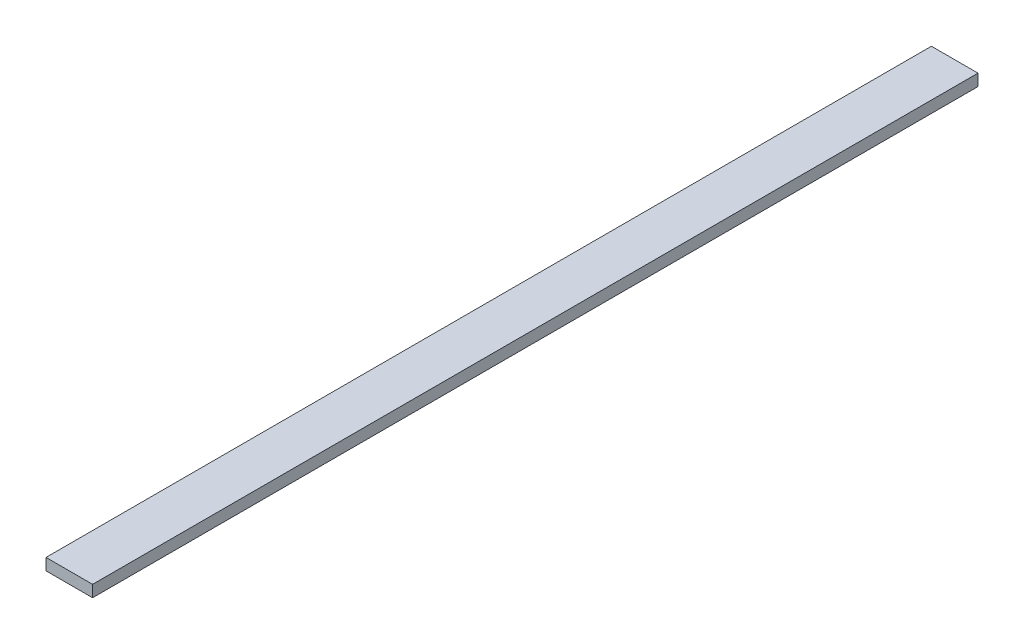
ISO-10303-21;
HEADER;
FILE_DESCRIPTION(('STEP AP214'),'2;1');
FILE_NAME('part.step','',(''),(''),'','','');
FILE_SCHEMA(('AUTOMOTIVE_DESIGN { 1 0 10303 214 1 1 1 1 }'));
ENDSEC;
DATA;
#1=APPLICATION_CONTEXT('core data for automotive mechanical design processes');
#2=APPLICATION_PROTOCOL_DEFINITION('international standard','automotive_design',2000,#1);
#3=PRODUCT_CONTEXT('',#1,'mechanical');
#4=PRODUCT('Part','Part','',(#3));
#5=PRODUCT_RELATED_PRODUCT_CATEGORY('part','',(#4));
#6=PRODUCT_DEFINITION_FORMATION('','',#4);
#7=PRODUCT_DEFINITION_CONTEXT('part definition',#1,'design');
#8=PRODUCT_DEFINITION('design','',#6,#7);
#9=PRODUCT_DEFINITION_SHAPE('','',#8);
#10=(LENGTH_UNIT() NAMED_UNIT(*) SI_UNIT(.MILLI.,.METRE.));
#11=(NAMED_UNIT(*) PLANE_ANGLE_UNIT() SI_UNIT($,.RADIAN.));
#12=(NAMED_UNIT(*) SI_UNIT($,.STERADIAN.) SOLID_ANGLE_UNIT());
#13=UNCERTAINTY_MEASURE_WITH_UNIT(LENGTH_MEASURE(1.E-05),#10,'distance_accuracy_value','');
#14=(GEOMETRIC_REPRESENTATION_CONTEXT(3) GLOBAL_UNCERTAINTY_ASSIGNED_CONTEXT((#13)) GLOBAL_UNIT_ASSIGNED_CONTEXT((#10,
#11,#12)) REPRESENTATION_CONTEXT('',''));
#15=CARTESIAN_POINT('',(0.,0.,0.));
#16=DIRECTION('',(0.,0.,1.));
#17=DIRECTION('',(1.,0.,0.));
#18=AXIS2_PLACEMENT_3D('',#15,#16,#17);
#19=CARTESIAN_POINT('',(0.,0.,241.3));
#20=DIRECTION('',(1.,0.,0.));
#21=DIRECTION('',(0.,0.,-1.));
#22=AXIS2_PLACEMENT_3D('',#19,#20,#21);
#23=PLANE('',#22);
#24=DIRECTION('',(0.,-1.,0.));
#25=VECTOR('',#24,1.);
#26=CARTESIAN_POINT('',(0.,0.,0.));
#27=LINE('',#26,#25);
#28=CARTESIAN_POINT('',(0.,3.175,0.));
#29=VERTEX_POINT('',#28);
#30=CARTESIAN_POINT('',(0.,0.,0.));
#31=VERTEX_POINT('',#30);
#32=EDGE_CURVE('E104',#29,#31,#27,.T.);
#33=ORIENTED_EDGE('',*,*,#32,.T.);
#34=DIRECTION('',(0.,0.,-1.));
#35=VECTOR('',#34,1.);
#36=CARTESIAN_POINT('',(0.,0.,241.3));
#37=LINE('',#36,#35);
#38=CARTESIAN_POINT('',(0.,0.,241.3));
#39=VERTEX_POINT('',#38);
#40=EDGE_CURVE('E11',#39,#31,#37,.T.);
#41=ORIENTED_EDGE('',*,*,#40,.F.);
#42=DIRECTION('',(0.,-1.,0.));
#43=VECTOR('',#42,1.);
#44=CARTESIAN_POINT('',(0.,0.,241.3));
#45=LINE('',#44,#43);
#46=CARTESIAN_POINT('',(0.,3.175,241.3));
#47=VERTEX_POINT('',#46);
#48=EDGE_CURVE('E92',#47,#39,#45,.T.);
#49=ORIENTED_EDGE('',*,*,#48,.F.);
#50=DIRECTION('',(0.,0.,-1.));
#51=VECTOR('',#50,1.);
#52=CARTESIAN_POINT('',(0.,3.175,241.3));
#53=LINE('',#52,#51);
#54=EDGE_CURVE('E100',#47,#29,#53,.T.);
#55=ORIENTED_EDGE('',*,*,#54,.T.);
#56=EDGE_LOOP('',(#33,#41,#49,#55));
#57=FACE_BOUND('',#56,.T.);
#58=ADVANCED_FACE('F41',(#57),#23,.F.);
#59=CARTESIAN_POINT('',(0.,0.,241.3));
#60=DIRECTION('',(0.,1.,0.));
#61=DIRECTION('',(0.,0.,1.));
#62=AXIS2_PLACEMENT_3D('',#59,#60,#61);
#63=PLANE('',#62);
#64=DIRECTION('',(1.,0.,0.));
#65=VECTOR('',#64,1.);
#66=CARTESIAN_POINT('',(0.,0.,0.));
#67=LINE('',#66,#65);
#68=CARTESIAN_POINT('',(12.7,0.,0.));
#69=VERTEX_POINT('',#68);
#70=EDGE_CURVE('E96',#31,#69,#67,.T.);
#71=ORIENTED_EDGE('',*,*,#70,.T.);
#72=DIRECTION('',(0.,0.,-1.));
#73=VECTOR('',#72,1.);
#74=CARTESIAN_POINT('',(12.7,0.,241.3));
#75=LINE('',#74,#73);
#76=CARTESIAN_POINT('',(12.7,0.,241.3));
#77=VERTEX_POINT('',#76);
#78=EDGE_CURVE('E49',#77,#69,#75,.T.);
#79=ORIENTED_EDGE('',*,*,#78,.F.);
#80=DIRECTION('',(1.,0.,0.));
#81=VECTOR('',#80,1.);
#82=CARTESIAN_POINT('',(0.,0.,241.3));
#83=LINE('',#82,#81);
#84=EDGE_CURVE('E87',#39,#77,#83,.T.);
#85=ORIENTED_EDGE('',*,*,#84,.F.);
#86=ORIENTED_EDGE('',*,*,#40,.T.);
#87=EDGE_LOOP('',(#71,#79,#85,#86));
#88=FACE_BOUND('',#87,.T.);
#89=ADVANCED_FACE('F95',(#88),#63,.F.);
#90=CARTESIAN_POINT('',(12.7,0.,241.3));
#91=DIRECTION('',(-1.,0.,0.));
#92=DIRECTION('',(0.,0.,1.));
#93=AXIS2_PLACEMENT_3D('',#90,#91,#92);
#94=PLANE('',#93);
#95=DIRECTION('',(0.,1.,0.));
#96=VECTOR('',#95,1.);
#97=CARTESIAN_POINT('',(12.7,0.,0.));
#98=LINE('',#97,#96);
#99=CARTESIAN_POINT('',(12.7,3.175,0.));
#100=VERTEX_POINT('',#99);
#101=EDGE_CURVE('E74',#69,#100,#98,.T.);
#102=ORIENTED_EDGE('',*,*,#101,.T.);
#103=DIRECTION('',(0.,0.,-1.));
#104=VECTOR('',#103,1.);
#105=CARTESIAN_POINT('',(12.7,3.175,241.3));
#106=LINE('',#105,#104);
#107=CARTESIAN_POINT('',(12.7,3.175,241.3));
#108=VERTEX_POINT('',#107);
#109=EDGE_CURVE('E97',#108,#100,#106,.T.);
#110=ORIENTED_EDGE('',*,*,#109,.F.);
#111=DIRECTION('',(0.,1.,0.));
#112=VECTOR('',#111,1.);
#113=CARTESIAN_POINT('',(12.7,0.,241.3));
#114=LINE('',#113,#112);
#115=EDGE_CURVE('E90',#77,#108,#114,.T.);
#116=ORIENTED_EDGE('',*,*,#115,.F.);
#117=ORIENTED_EDGE('',*,*,#78,.T.);
#118=EDGE_LOOP('',(#102,#110,#116,#117));
#119=FACE_BOUND('',#118,.T.);
#120=ADVANCED_FACE('F98',(#119),#94,.F.);
#121=CARTESIAN_POINT('',(0.,3.175,241.3));
#122=DIRECTION('',(0.,-1.,0.));
#123=DIRECTION('',(0.,0.,-1.));
#124=AXIS2_PLACEMENT_3D('',#121,#122,#123);
#125=PLANE('',#124);
#126=DIRECTION('',(-1.,0.,0.));
#127=VECTOR('',#126,1.);
#128=CARTESIAN_POINT('',(0.,3.175,0.));
#129=LINE('',#128,#127);
#130=EDGE_CURVE('E80',#100,#29,#129,.T.);
#131=ORIENTED_EDGE('',*,*,#130,.T.);
#132=ORIENTED_EDGE('',*,*,#54,.F.);
#133=DIRECTION('',(-1.,0.,0.));
#134=VECTOR('',#133,1.);
#135=CARTESIAN_POINT('',(0.,3.175,241.3));
#136=LINE('',#135,#134);
#137=EDGE_CURVE('E57',#108,#47,#136,.T.);
#138=ORIENTED_EDGE('',*,*,#137,.F.);
#139=ORIENTED_EDGE('',*,*,#109,.T.);
#140=EDGE_LOOP('',(#131,#132,#138,#139));
#141=FACE_BOUND('',#140,.T.);
#142=ADVANCED_FACE('F111',(#141),#125,.F.);
#143=CARTESIAN_POINT('',(0.,0.,241.3));
#144=DIRECTION('',(0.,0.,-1.));
#145=DIRECTION('',(-1.,0.,0.));
#146=AXIS2_PLACEMENT_3D('',#143,#144,#145);
#147=PLANE('',#146);
#148=ORIENTED_EDGE('',*,*,#48,.T.);
#149=ORIENTED_EDGE('',*,*,#84,.T.);
#150=ORIENTED_EDGE('',*,*,#115,.T.);
#151=ORIENTED_EDGE('',*,*,#137,.T.);
#152=EDGE_LOOP('',(#148,#149,#150,#151));
#153=FACE_BOUND('',#152,.T.);
#154=ADVANCED_FACE('F88',(#153),#147,.F.);
#155=CARTESIAN_POINT('',(0.,0.,0.));
#156=DIRECTION('',(0.,0.,-1.));
#157=DIRECTION('',(-1.,0.,0.));
#158=AXIS2_PLACEMENT_3D('',#155,#156,#157);
#159=PLANE('',#158);
#160=ORIENTED_EDGE('',*,*,#32,.F.);
#161=ORIENTED_EDGE('',*,*,#130,.F.);
#162=ORIENTED_EDGE('',*,*,#101,.F.);
#163=ORIENTED_EDGE('',*,*,#70,.F.);
#164=EDGE_LOOP('',(#160,#161,#162,#163));
#165=FACE_BOUND('',#164,.T.);
#166=ADVANCED_FACE('F114',(#165),#159,.T.);
#167=CLOSED_SHELL('',(#58,#89,#120,#142,#154,#166));
#168=MANIFOLD_SOLID_BREP('B2',#167);
#169=ADVANCED_BREP_SHAPE_REPRESENTATION('',(#18,#168),#14);
#170=SHAPE_DEFINITION_REPRESENTATION(#9,#169);
ENDSEC;
END-ISO-10303-21;
